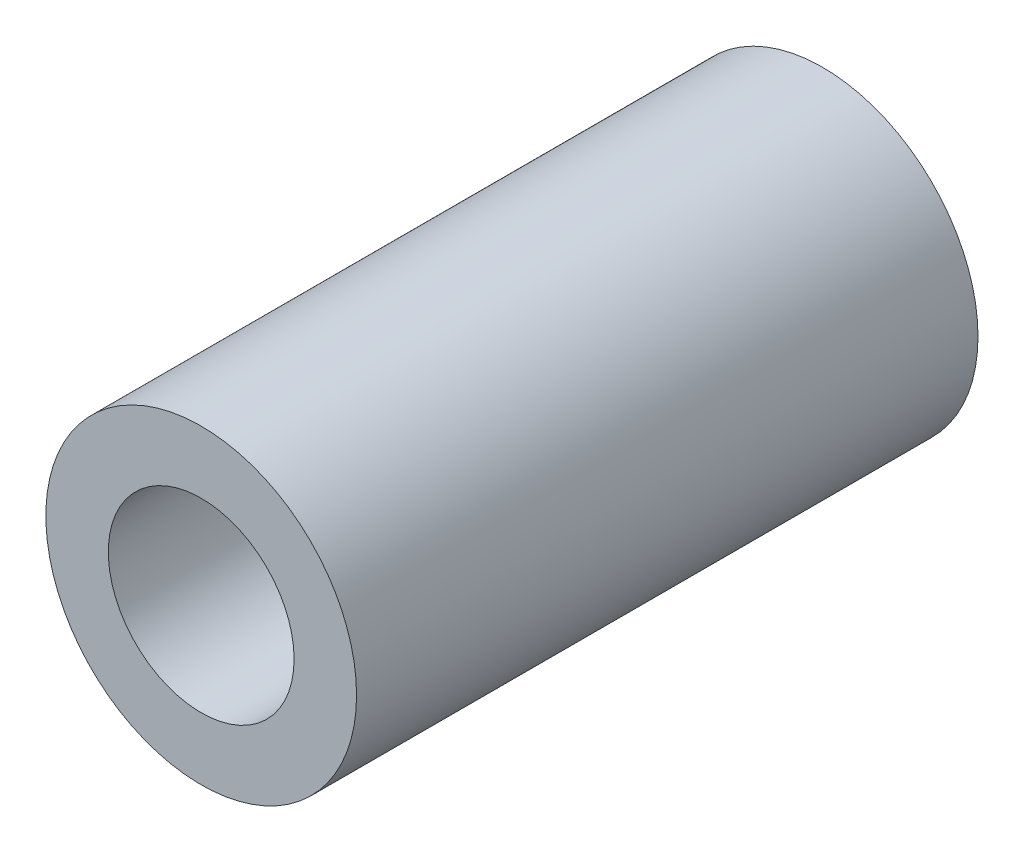
ISO-10303-21;
HEADER;
FILE_DESCRIPTION(('STEP AP214'),'2;1');
FILE_NAME('part.step','',(''),(''),'','','');
FILE_SCHEMA(('AUTOMOTIVE_DESIGN { 1 0 10303 214 1 1 1 1 }'));
ENDSEC;
DATA;
#1=APPLICATION_CONTEXT('core data for automotive mechanical design processes');
#2=APPLICATION_PROTOCOL_DEFINITION('international standard','automotive_design',2000,#1);
#3=PRODUCT_CONTEXT('',#1,'mechanical');
#4=PRODUCT('Part','Part','',(#3));
#5=PRODUCT_RELATED_PRODUCT_CATEGORY('part','',(#4));
#6=PRODUCT_DEFINITION_FORMATION('','',#4);
#7=PRODUCT_DEFINITION_CONTEXT('part definition',#1,'design');
#8=PRODUCT_DEFINITION('design','',#6,#7);
#9=PRODUCT_DEFINITION_SHAPE('','',#8);
#10=(LENGTH_UNIT() NAMED_UNIT(*) SI_UNIT(.MILLI.,.METRE.));
#11=(NAMED_UNIT(*) PLANE_ANGLE_UNIT() SI_UNIT($,.RADIAN.));
#12=(NAMED_UNIT(*) SI_UNIT($,.STERADIAN.) SOLID_ANGLE_UNIT());
#13=UNCERTAINTY_MEASURE_WITH_UNIT(LENGTH_MEASURE(1.E-05),#10,'distance_accuracy_value','');
#14=(GEOMETRIC_REPRESENTATION_CONTEXT(3) GLOBAL_UNCERTAINTY_ASSIGNED_CONTEXT((#13)) GLOBAL_UNIT_ASSIGNED_CONTEXT((#10,
#11,#12)) REPRESENTATION_CONTEXT('',''));
#15=CARTESIAN_POINT('',(0.,0.,0.));
#16=DIRECTION('',(0.,0.,1.));
#17=DIRECTION('',(1.,0.,0.));
#18=AXIS2_PLACEMENT_3D('',#15,#16,#17);
#19=CARTESIAN_POINT('',(0.,0.,12.7));
#20=DIRECTION('',(0.,0.,-1.));
#21=DIRECTION('',(-1.,0.,0.));
#22=AXIS2_PLACEMENT_3D('',#19,#20,#21);
#23=CYLINDRICAL_SURFACE('',#22,3.175);
#24=CARTESIAN_POINT('',(0.,0.,12.7));
#25=DIRECTION('',(0.,0.,1.));
#26=DIRECTION('',(1.,0.,0.));
#27=AXIS2_PLACEMENT_3D('',#24,#25,#26);
#28=CIRCLE('',#27,3.175);
#29=CARTESIAN_POINT('',(3.175,0.,12.7));
#30=VERTEX_POINT('',#29);
#31=EDGE_CURVE('E10',#30,#30,#28,.T.);
#32=ORIENTED_EDGE('',*,*,#31,.F.);
#33=EDGE_LOOP('',(#32));
#34=FACE_BOUND('',#33,.T.);
#35=CARTESIAN_POINT('',(0.,0.,0.));
#36=DIRECTION('',(0.,0.,1.));
#37=DIRECTION('',(1.,0.,0.));
#38=AXIS2_PLACEMENT_3D('',#35,#36,#37);
#39=CIRCLE('',#38,3.175);
#40=CARTESIAN_POINT('',(3.175,0.,0.));
#41=VERTEX_POINT('',#40);
#42=EDGE_CURVE('E34',#41,#41,#39,.T.);
#43=ORIENTED_EDGE('',*,*,#42,.T.);
#44=EDGE_LOOP('',(#43));
#45=FACE_BOUND('',#44,.T.);
#46=ADVANCED_FACE('F31',(#34,#45),#23,.T.);
#47=CARTESIAN_POINT('',(0.,0.,12.7));
#48=DIRECTION('',(0.,0.,1.));
#49=DIRECTION('',(1.,0.,0.));
#50=AXIS2_PLACEMENT_3D('',#47,#48,#49);
#51=PLANE('',#50);
#52=CARTESIAN_POINT('',(0.,0.,12.7));
#53=DIRECTION('',(0.,0.,1.));
#54=DIRECTION('',(1.,0.,0.));
#55=AXIS2_PLACEMENT_3D('',#52,#53,#54);
#56=CIRCLE('',#55,1.89865);
#57=CARTESIAN_POINT('',(1.89865,0.,12.7));
#58=VERTEX_POINT('',#57);
#59=EDGE_CURVE('E45',#58,#58,#56,.T.);
#60=ORIENTED_EDGE('',*,*,#59,.F.);
#61=EDGE_LOOP('',(#60));
#62=FACE_BOUND('',#61,.T.);
#63=ORIENTED_EDGE('',*,*,#31,.T.);
#64=EDGE_LOOP('',(#63));
#65=FACE_BOUND('',#64,.T.);
#66=ADVANCED_FACE('F51',(#62,#65),#51,.T.);
#67=CARTESIAN_POINT('',(0.,0.,0.));
#68=DIRECTION('',(0.,0.,1.));
#69=DIRECTION('',(1.,0.,0.));
#70=AXIS2_PLACEMENT_3D('',#67,#68,#69);
#71=PLANE('',#70);
#72=CARTESIAN_POINT('',(0.,0.,0.));
#73=DIRECTION('',(0.,0.,1.));
#74=DIRECTION('',(1.,0.,0.));
#75=AXIS2_PLACEMENT_3D('',#72,#73,#74);
#76=CIRCLE('',#75,1.89865);
#77=CARTESIAN_POINT('',(1.89865,0.,0.));
#78=VERTEX_POINT('',#77);
#79=EDGE_CURVE('E41',#78,#78,#76,.T.);
#80=ORIENTED_EDGE('',*,*,#79,.T.);
#81=EDGE_LOOP('',(#80));
#82=FACE_BOUND('',#81,.T.);
#83=ORIENTED_EDGE('',*,*,#42,.F.);
#84=EDGE_LOOP('',(#83));
#85=FACE_BOUND('',#84,.T.);
#86=ADVANCED_FACE('F53',(#82,#85),#71,.F.);
#87=CARTESIAN_POINT('',(0.,0.,12.7));
#88=DIRECTION('',(0.,0.,1.));
#89=DIRECTION('',(1.,0.,0.));
#90=AXIS2_PLACEMENT_3D('',#87,#88,#89);
#91=CYLINDRICAL_SURFACE('',#90,1.89865);
#92=ORIENTED_EDGE('',*,*,#79,.F.);
#93=EDGE_LOOP('',(#92));
#94=FACE_BOUND('',#93,.T.);
#95=ORIENTED_EDGE('',*,*,#59,.T.);
#96=EDGE_LOOP('',(#95));
#97=FACE_BOUND('',#96,.T.);
#98=ADVANCED_FACE('F49',(#94,#97),#91,.F.);
#99=CLOSED_SHELL('',(#46,#66,#86,#98));
#100=MANIFOLD_SOLID_BREP('B2',#99);
#101=ADVANCED_BREP_SHAPE_REPRESENTATION('',(#18,#100),#14);
#102=SHAPE_DEFINITION_REPRESENTATION(#9,#101);
ENDSEC;
END-ISO-10303-21;
